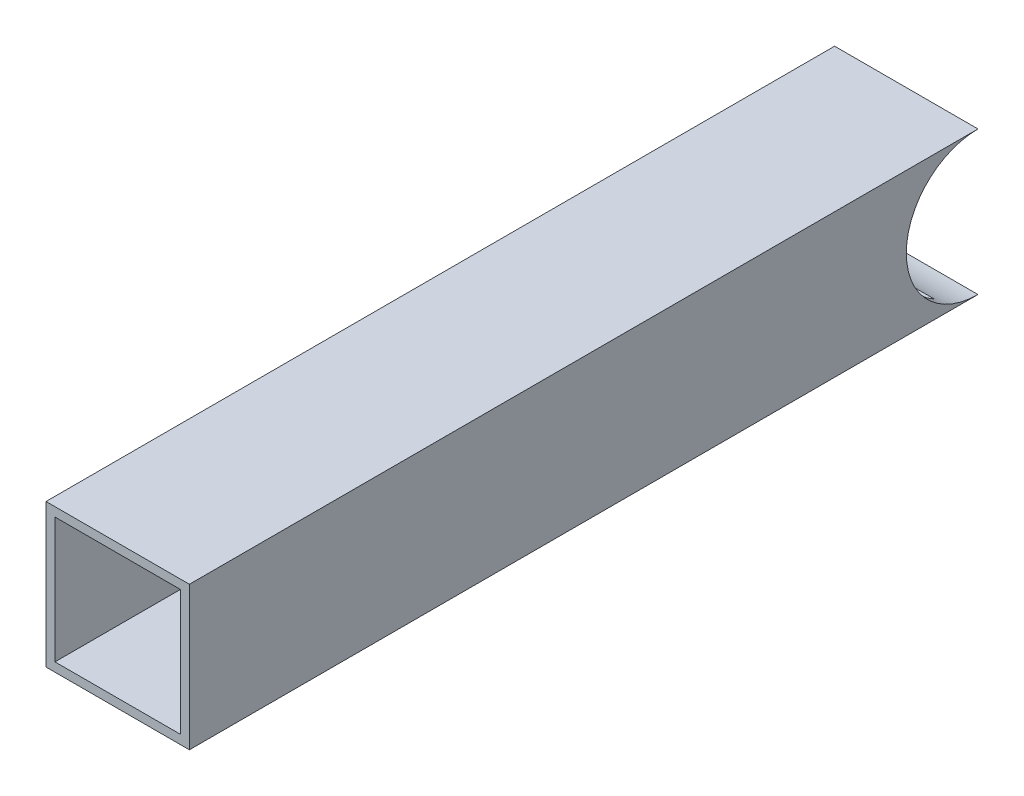
ISO-10303-21;
HEADER;
FILE_DESCRIPTION(('STEP AP214'),'2;1');
FILE_NAME('part.step','',(''),(''),'','','');
FILE_SCHEMA(('AUTOMOTIVE_DESIGN { 1 0 10303 214 1 1 1 1 }'));
ENDSEC;
DATA;
#1=APPLICATION_CONTEXT('core data for automotive mechanical design processes');
#2=APPLICATION_PROTOCOL_DEFINITION('international standard','automotive_design',2000,#1);
#3=PRODUCT_CONTEXT('',#1,'mechanical');
#4=PRODUCT('Part','Part','',(#3));
#5=PRODUCT_RELATED_PRODUCT_CATEGORY('part','',(#4));
#6=PRODUCT_DEFINITION_FORMATION('','',#4);
#7=PRODUCT_DEFINITION_CONTEXT('part definition',#1,'design');
#8=PRODUCT_DEFINITION('design','',#6,#7);
#9=PRODUCT_DEFINITION_SHAPE('','',#8);
#10=(LENGTH_UNIT() NAMED_UNIT(*) SI_UNIT(.MILLI.,.METRE.));
#11=(NAMED_UNIT(*) PLANE_ANGLE_UNIT() SI_UNIT($,.RADIAN.));
#12=(NAMED_UNIT(*) SI_UNIT($,.STERADIAN.) SOLID_ANGLE_UNIT());
#13=UNCERTAINTY_MEASURE_WITH_UNIT(LENGTH_MEASURE(1.E-05),#10,'distance_accuracy_value','');
#14=(GEOMETRIC_REPRESENTATION_CONTEXT(3) GLOBAL_UNCERTAINTY_ASSIGNED_CONTEXT((#13)) GLOBAL_UNIT_ASSIGNED_CONTEXT((#10,
#11,#12)) REPRESENTATION_CONTEXT('',''));
#15=CARTESIAN_POINT('',(0.,0.,0.));
#16=DIRECTION('',(0.,0.,1.));
#17=DIRECTION('',(1.,0.,0.));
#18=AXIS2_PLACEMENT_3D('',#15,#16,#17);
#19=CARTESIAN_POINT('',(0.,0.,279.4));
#20=DIRECTION('',(0.,0.,-1.));
#21=DIRECTION('',(-1.,0.,0.));
#22=AXIS2_PLACEMENT_3D('',#19,#20,#21);
#23=PLANE('',#22);
#24=DIRECTION('',(0.,1.,0.));
#25=VECTOR('',#24,1.);
#26=CARTESIAN_POINT('',(25.4,-25.4,279.4));
#27=LINE('',#26,#25);
#28=CARTESIAN_POINT('',(25.4,-25.4,279.4));
#29=VERTEX_POINT('',#28);
#30=CARTESIAN_POINT('',(25.4,25.4,279.4));
#31=VERTEX_POINT('',#30);
#32=EDGE_CURVE('E138',#29,#31,#27,.T.);
#33=ORIENTED_EDGE('',*,*,#32,.T.);
#34=DIRECTION('',(-1.,0.,0.));
#35=VECTOR('',#34,1.);
#36=CARTESIAN_POINT('',(-25.4,25.4,279.4));
#37=LINE('',#36,#35);
#38=CARTESIAN_POINT('',(-25.4,25.4,279.4));
#39=VERTEX_POINT('',#38);
#40=EDGE_CURVE('E142',#31,#39,#37,.T.);
#41=ORIENTED_EDGE('',*,*,#40,.T.);
#42=DIRECTION('',(0.,-1.,0.));
#43=VECTOR('',#42,1.);
#44=CARTESIAN_POINT('',(-25.4,-25.4,279.4));
#45=LINE('',#44,#43);
#46=CARTESIAN_POINT('',(-25.4,-25.4,279.4));
#47=VERTEX_POINT('',#46);
#48=EDGE_CURVE('E146',#39,#47,#45,.T.);
#49=ORIENTED_EDGE('',*,*,#48,.T.);
#50=DIRECTION('',(1.,0.,0.));
#51=VECTOR('',#50,1.);
#52=CARTESIAN_POINT('',(-25.4,-25.4,279.4));
#53=LINE('',#52,#51);
#54=EDGE_CURVE('E149',#47,#29,#53,.T.);
#55=ORIENTED_EDGE('',*,*,#54,.T.);
#56=EDGE_LOOP('',(#33,#41,#49,#55));
#57=FACE_BOUND('',#56,.T.);
#58=DIRECTION('',(0.,-1.,0.));
#59=VECTOR('',#58,1.);
#60=CARTESIAN_POINT('',(-22.225,-22.225,279.4));
#61=LINE('',#60,#59);
#62=CARTESIAN_POINT('',(-22.225,22.225,279.4));
#63=VERTEX_POINT('',#62);
#64=CARTESIAN_POINT('',(-22.225,-22.225,279.4));
#65=VERTEX_POINT('',#64);
#66=EDGE_CURVE('E181',#63,#65,#61,.T.);
#67=ORIENTED_EDGE('',*,*,#66,.F.);
#68=DIRECTION('',(-1.,0.,0.));
#69=VECTOR('',#68,1.);
#70=CARTESIAN_POINT('',(-22.225,22.225,279.4));
#71=LINE('',#70,#69);
#72=CARTESIAN_POINT('',(22.225,22.225,279.4));
#73=VERTEX_POINT('',#72);
#74=EDGE_CURVE('E121',#73,#63,#71,.T.);
#75=ORIENTED_EDGE('',*,*,#74,.F.);
#76=DIRECTION('',(0.,1.,0.));
#77=VECTOR('',#76,1.);
#78=CARTESIAN_POINT('',(22.225,-22.225,279.4));
#79=LINE('',#78,#77);
#80=CARTESIAN_POINT('',(22.225,-22.225,279.4));
#81=VERTEX_POINT('',#80);
#82=EDGE_CURVE('E128',#81,#73,#79,.T.);
#83=ORIENTED_EDGE('',*,*,#82,.F.);
#84=DIRECTION('',(1.,0.,0.));
#85=VECTOR('',#84,1.);
#86=CARTESIAN_POINT('',(-22.225,-22.225,279.4));
#87=LINE('',#86,#85);
#88=EDGE_CURVE('E185',#65,#81,#87,.T.);
#89=ORIENTED_EDGE('',*,*,#88,.F.);
#90=EDGE_LOOP('',(#67,#75,#83,#89));
#91=FACE_BOUND('',#90,.T.);
#92=ADVANCED_FACE('F39',(#57,#91),#23,.F.);
#93=CARTESIAN_POINT('',(25.4,-25.4,279.4));
#94=DIRECTION('',(-1.,0.,0.));
#95=DIRECTION('',(0.,0.,1.));
#96=AXIS2_PLACEMENT_3D('',#93,#94,#95);
#97=PLANE('',#96);
#98=DIRECTION('',(0.,0.,-1.));
#99=VECTOR('',#98,1.);
#100=CARTESIAN_POINT('',(25.4,-25.4,279.4));
#101=LINE('',#100,#99);
#102=CARTESIAN_POINT('',(25.4,-25.4,0.));
#103=VERTEX_POINT('',#102);
#104=EDGE_CURVE('E152',#29,#103,#101,.T.);
#105=ORIENTED_EDGE('',*,*,#104,.T.);
#106=CARTESIAN_POINT('',(25.4,0.,0.));
#107=DIRECTION('',(-1.,0.,0.));
#108=DIRECTION('',(0.,0.,1.));
#109=AXIS2_PLACEMENT_3D('',#106,#107,#108);
#110=CIRCLE('',#109,25.4);
#111=CARTESIAN_POINT('',(25.4,25.4,0.));
#112=VERTEX_POINT('',#111);
#113=EDGE_CURVE('E178',#103,#112,#110,.T.);
#114=ORIENTED_EDGE('',*,*,#113,.T.);
#115=DIRECTION('',(0.,0.,-1.));
#116=VECTOR('',#115,1.);
#117=CARTESIAN_POINT('',(25.4,25.4,279.4));
#118=LINE('',#117,#116);
#119=EDGE_CURVE('E48',#31,#112,#118,.T.);
#120=ORIENTED_EDGE('',*,*,#119,.F.);
#121=ORIENTED_EDGE('',*,*,#32,.F.);
#122=EDGE_LOOP('',(#105,#114,#120,#121));
#123=FACE_BOUND('',#122,.T.);
#124=ADVANCED_FACE('F41',(#123),#97,.F.);
#125=CARTESIAN_POINT('',(-25.4,25.4,279.4));
#126=DIRECTION('',(0.,-1.,0.));
#127=DIRECTION('',(0.,0.,-1.));
#128=AXIS2_PLACEMENT_3D('',#125,#126,#127);
#129=PLANE('',#128);
#130=DIRECTION('',(-1.,0.,0.));
#131=VECTOR('',#130,1.);
#132=CARTESIAN_POINT('',(-25.4,25.4,0.));
#133=LINE('',#132,#131);
#134=CARTESIAN_POINT('',(-25.4,25.4,0.));
#135=VERTEX_POINT('',#134);
#136=EDGE_CURVE('E137',#112,#135,#133,.T.);
#137=ORIENTED_EDGE('',*,*,#136,.T.);
#138=DIRECTION('',(0.,0.,-1.));
#139=VECTOR('',#138,1.);
#140=CARTESIAN_POINT('',(-25.4,25.4,279.4));
#141=LINE('',#140,#139);
#142=EDGE_CURVE('E166',#39,#135,#141,.T.);
#143=ORIENTED_EDGE('',*,*,#142,.F.);
#144=ORIENTED_EDGE('',*,*,#40,.F.);
#145=ORIENTED_EDGE('',*,*,#119,.T.);
#146=EDGE_LOOP('',(#137,#143,#144,#145));
#147=FACE_BOUND('',#146,.T.);
#148=ADVANCED_FACE('F173',(#147),#129,.F.);
#149=CARTESIAN_POINT('',(-25.4,-25.4,279.4));
#150=DIRECTION('',(1.,0.,0.));
#151=DIRECTION('',(0.,0.,-1.));
#152=AXIS2_PLACEMENT_3D('',#149,#150,#151);
#153=PLANE('',#152);
#154=ORIENTED_EDGE('',*,*,#142,.T.);
#155=CARTESIAN_POINT('',(-25.4,0.,0.));
#156=DIRECTION('',(1.,0.,0.));
#157=DIRECTION('',(0.,0.,-1.));
#158=AXIS2_PLACEMENT_3D('',#155,#156,#157);
#159=CIRCLE('',#158,25.4);
#160=CARTESIAN_POINT('',(-25.4,-25.4,0.));
#161=VERTEX_POINT('',#160);
#162=EDGE_CURVE('E116',#135,#161,#159,.T.);
#163=ORIENTED_EDGE('',*,*,#162,.T.);
#164=DIRECTION('',(0.,0.,-1.));
#165=VECTOR('',#164,1.);
#166=CARTESIAN_POINT('',(-25.4,-25.4,279.4));
#167=LINE('',#166,#165);
#168=EDGE_CURVE('E162',#47,#161,#167,.T.);
#169=ORIENTED_EDGE('',*,*,#168,.F.);
#170=ORIENTED_EDGE('',*,*,#48,.F.);
#171=EDGE_LOOP('',(#154,#163,#169,#170));
#172=FACE_BOUND('',#171,.T.);
#173=ADVANCED_FACE('F222',(#172),#153,.F.);
#174=CARTESIAN_POINT('',(-25.4,-25.4,279.4));
#175=DIRECTION('',(0.,1.,0.));
#176=DIRECTION('',(0.,0.,1.));
#177=AXIS2_PLACEMENT_3D('',#174,#175,#176);
#178=PLANE('',#177);
#179=DIRECTION('',(1.,0.,0.));
#180=VECTOR('',#179,1.);
#181=CARTESIAN_POINT('',(-25.4,-25.4,0.));
#182=LINE('',#181,#180);
#183=EDGE_CURVE('E143',#161,#103,#182,.T.);
#184=ORIENTED_EDGE('',*,*,#183,.T.);
#185=ORIENTED_EDGE('',*,*,#104,.F.);
#186=ORIENTED_EDGE('',*,*,#54,.F.);
#187=ORIENTED_EDGE('',*,*,#168,.T.);
#188=EDGE_LOOP('',(#184,#185,#186,#187));
#189=FACE_BOUND('',#188,.T.);
#190=ADVANCED_FACE('F211',(#189),#178,.F.);
#191=CARTESIAN_POINT('',(-22.225,-22.225,279.4));
#192=DIRECTION('',(1.,0.,0.));
#193=DIRECTION('',(0.,0.,-1.));
#194=AXIS2_PLACEMENT_3D('',#191,#192,#193);
#195=PLANE('',#194);
#196=CARTESIAN_POINT('',(-22.225,0.,0.));
#197=DIRECTION('',(1.,0.,0.));
#198=DIRECTION('',(0.,0.,-1.));
#199=AXIS2_PLACEMENT_3D('',#196,#197,#198);
#200=CIRCLE('',#199,25.4);
#201=CARTESIAN_POINT('',(-22.225,22.225,12.2967221242086));
#202=VERTEX_POINT('',#201);
#203=CARTESIAN_POINT('',(-22.225,-22.225,12.2967221242086));
#204=VERTEX_POINT('',#203);
#205=EDGE_CURVE('E104',#202,#204,#200,.T.);
#206=ORIENTED_EDGE('',*,*,#205,.F.);
#207=DIRECTION('',(0.,0.,-1.));
#208=VECTOR('',#207,1.);
#209=CARTESIAN_POINT('',(-22.225,22.225,279.4));
#210=LINE('',#209,#208);
#211=EDGE_CURVE('E111',#63,#202,#210,.T.);
#212=ORIENTED_EDGE('',*,*,#211,.F.);
#213=ORIENTED_EDGE('',*,*,#66,.T.);
#214=DIRECTION('',(0.,0.,-1.));
#215=VECTOR('',#214,1.);
#216=CARTESIAN_POINT('',(-22.225,-22.225,279.4));
#217=LINE('',#216,#215);
#218=EDGE_CURVE('E114',#65,#204,#217,.T.);
#219=ORIENTED_EDGE('',*,*,#218,.T.);
#220=EDGE_LOOP('',(#206,#212,#213,#219));
#221=FACE_BOUND('',#220,.T.);
#222=ADVANCED_FACE('F110',(#221),#195,.T.);
#223=CARTESIAN_POINT('',(-22.225,-22.225,279.4));
#224=DIRECTION('',(0.,1.,0.));
#225=DIRECTION('',(0.,0.,1.));
#226=AXIS2_PLACEMENT_3D('',#223,#224,#225);
#227=PLANE('',#226);
#228=DIRECTION('',(1.,0.,0.));
#229=VECTOR('',#228,1.);
#230=CARTESIAN_POINT('',(-139.7,-22.225,12.2967221242086));
#231=LINE('',#230,#229);
#232=CARTESIAN_POINT('',(22.225,-22.225,12.2967221242086));
#233=VERTEX_POINT('',#232);
#234=EDGE_CURVE('E117',#204,#233,#231,.T.);
#235=ORIENTED_EDGE('',*,*,#234,.F.);
#236=ORIENTED_EDGE('',*,*,#218,.F.);
#237=ORIENTED_EDGE('',*,*,#88,.T.);
#238=DIRECTION('',(0.,0.,-1.));
#239=VECTOR('',#238,1.);
#240=CARTESIAN_POINT('',(22.225,-22.225,279.4));
#241=LINE('',#240,#239);
#242=EDGE_CURVE('E126',#81,#233,#241,.T.);
#243=ORIENTED_EDGE('',*,*,#242,.T.);
#244=EDGE_LOOP('',(#235,#236,#237,#243));
#245=FACE_BOUND('',#244,.T.);
#246=ADVANCED_FACE('F199',(#245),#227,.T.);
#247=CARTESIAN_POINT('',(22.225,-22.225,279.4));
#248=DIRECTION('',(-1.,0.,0.));
#249=DIRECTION('',(0.,-1.,0.));
#250=AXIS2_PLACEMENT_3D('',#247,#248,#249);
#251=PLANE('',#250);
#252=CARTESIAN_POINT('',(22.225,0.,0.));
#253=DIRECTION('',(-1.,0.,0.));
#254=DIRECTION('',(0.,-1.,0.));
#255=AXIS2_PLACEMENT_3D('',#252,#253,#254);
#256=CIRCLE('',#255,25.4);
#257=CARTESIAN_POINT('',(22.225,22.225,12.2967221242086));
#258=VERTEX_POINT('',#257);
#259=EDGE_CURVE('E54',#233,#258,#256,.T.);
#260=ORIENTED_EDGE('',*,*,#259,.F.);
#261=ORIENTED_EDGE('',*,*,#242,.F.);
#262=ORIENTED_EDGE('',*,*,#82,.T.);
#263=DIRECTION('',(0.,0.,-1.));
#264=VECTOR('',#263,1.);
#265=CARTESIAN_POINT('',(22.225,22.225,279.4));
#266=LINE('',#265,#264);
#267=EDGE_CURVE('E61',#73,#258,#266,.T.);
#268=ORIENTED_EDGE('',*,*,#267,.T.);
#269=EDGE_LOOP('',(#260,#261,#262,#268));
#270=FACE_BOUND('',#269,.T.);
#271=ADVANCED_FACE('F195',(#270),#251,.T.);
#272=CARTESIAN_POINT('',(-22.225,22.225,279.4));
#273=DIRECTION('',(0.,-1.,0.));
#274=DIRECTION('',(1.,0.,0.));
#275=AXIS2_PLACEMENT_3D('',#272,#273,#274);
#276=PLANE('',#275);
#277=DIRECTION('',(1.,0.,0.));
#278=VECTOR('',#277,1.);
#279=CARTESIAN_POINT('',(-139.7,22.225,12.2967221242086));
#280=LINE('',#279,#278);
#281=EDGE_CURVE('E11',#258,#202,#280,.F.);
#282=ORIENTED_EDGE('',*,*,#281,.F.);
#283=ORIENTED_EDGE('',*,*,#267,.F.);
#284=ORIENTED_EDGE('',*,*,#74,.T.);
#285=ORIENTED_EDGE('',*,*,#211,.T.);
#286=EDGE_LOOP('',(#282,#283,#284,#285));
#287=FACE_BOUND('',#286,.T.);
#288=ADVANCED_FACE('F119',(#287),#276,.T.);
#289=CARTESIAN_POINT('',(-139.7,0.,0.));
#290=DIRECTION('',(1.,0.,0.));
#291=DIRECTION('',(0.,0.,-1.));
#292=AXIS2_PLACEMENT_3D('',#289,#290,#291);
#293=CYLINDRICAL_SURFACE('',#292,25.4);
#294=ORIENTED_EDGE('',*,*,#205,.T.);
#295=ORIENTED_EDGE('',*,*,#234,.T.);
#296=ORIENTED_EDGE('',*,*,#259,.T.);
#297=ORIENTED_EDGE('',*,*,#281,.T.);
#298=EDGE_LOOP('',(#294,#295,#296,#297));
#299=FACE_BOUND('',#298,.T.);
#300=ORIENTED_EDGE('',*,*,#183,.F.);
#301=ORIENTED_EDGE('',*,*,#162,.F.);
#302=ORIENTED_EDGE('',*,*,#136,.F.);
#303=ORIENTED_EDGE('',*,*,#113,.F.);
#304=EDGE_LOOP('',(#300,#301,#302,#303));
#305=FACE_BOUND('',#304,.T.);
#306=ADVANCED_FACE('F102',(#299,#305),#293,.F.);
#307=CLOSED_SHELL('',(#92,#124,#148,#173,#190,#222,#246,#271,#288,#306));
#308=MANIFOLD_SOLID_BREP('B2',#307);
#309=ADVANCED_BREP_SHAPE_REPRESENTATION('',(#18,#308),#14);
#310=SHAPE_DEFINITION_REPRESENTATION(#9,#309);
ENDSEC;
END-ISO-10303-21;
